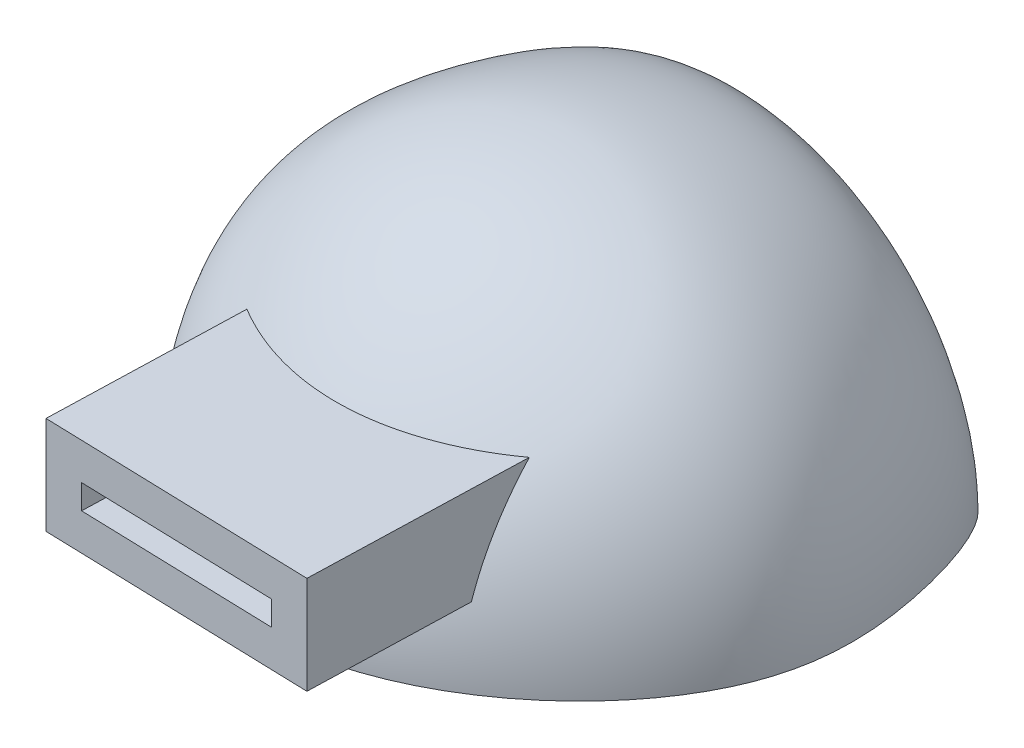
ISO-10303-21;
HEADER;
FILE_DESCRIPTION(('STEP AP214'),'2;1');
FILE_NAME('part.step','',(''),(''),'','','');
FILE_SCHEMA(('AUTOMOTIVE_DESIGN { 1 0 10303 214 1 1 1 1 }'));
ENDSEC;
DATA;
#1=APPLICATION_CONTEXT('core data for automotive mechanical design processes');
#2=APPLICATION_PROTOCOL_DEFINITION('international standard','automotive_design',2000,#1);
#3=PRODUCT_CONTEXT('',#1,'mechanical');
#4=PRODUCT('Part','Part','',(#3));
#5=PRODUCT_RELATED_PRODUCT_CATEGORY('part','',(#4));
#6=PRODUCT_DEFINITION_FORMATION('','',#4);
#7=PRODUCT_DEFINITION_CONTEXT('part definition',#1,'design');
#8=PRODUCT_DEFINITION('design','',#6,#7);
#9=PRODUCT_DEFINITION_SHAPE('','',#8);
#10=(LENGTH_UNIT() NAMED_UNIT(*) SI_UNIT(.MILLI.,.METRE.));
#11=(NAMED_UNIT(*) PLANE_ANGLE_UNIT() SI_UNIT($,.RADIAN.));
#12=(NAMED_UNIT(*) SI_UNIT($,.STERADIAN.) SOLID_ANGLE_UNIT());
#13=UNCERTAINTY_MEASURE_WITH_UNIT(LENGTH_MEASURE(1.E-05),#10,'distance_accuracy_value','');
#14=(GEOMETRIC_REPRESENTATION_CONTEXT(3) GLOBAL_UNCERTAINTY_ASSIGNED_CONTEXT((#13)) GLOBAL_UNIT_ASSIGNED_CONTEXT((#10,
#11,#12)) REPRESENTATION_CONTEXT('',''));
#15=CARTESIAN_POINT('',(0.,0.,0.));
#16=DIRECTION('',(0.,0.,1.));
#17=DIRECTION('',(1.,0.,0.));
#18=AXIS2_PLACEMENT_3D('',#15,#16,#17);
#19=CARTESIAN_POINT('',(32.4962022469968,0.,102.83057949245));
#20=CARTESIAN_POINT('',(3.63740284581316,-2.01519919141301E-13,101.966794634852));
#21=CARTESIAN_POINT('',(-41.2918886215931,-5.15259484593087E-13,68.6518971640335));
#22=CARTESIAN_POINT('',(-47.3556817021126,-5.57602725359566E-13,13.7258285385595));
#23=CARTESIAN_POINT('',(-28.0490768948956,-4.22785424557932E-13,-34.1624550244812));
#24=CARTESIAN_POINT('',(-17.0656238086389,-3.46088381584483E-13,-7.87034548185628));
#25=B_SPLINE_CURVE_WITH_KNOTS('',3,(#19,#20,#21,#22,#23,#24),.UNSPECIFIED.,.F.,.F.,(4,1,1,4),
(0.,0.487288000526579,0.732410890174815,1.),.UNSPECIFIED.);
#26=CARTESIAN_POINT('',(32.4962022469969,0.,75.7592184914926));
#27=DIRECTION('',(0.,0.,-1.));
#28=AXIS1_PLACEMENT('',#26,#27);
#29=SURFACE_OF_REVOLUTION('',#25,#28);
#30=CARTESIAN_POINT('',(70.6752901827735,19.0044396901906,87.1628960990123));
#31=CARTESIAN_POINT('',(70.1627807045949,19.0044396901906,87.4924475623718));
#32=CARTESIAN_POINT('',(69.6468866148386,19.0044396901906,87.8167075736631));
#33=CARTESIAN_POINT('',(68.6084453018209,19.0044396901906,88.4544057348588));
#34=CARTESIAN_POINT('',(68.0858980032465,19.0044396901906,88.7678437621112));
#35=CARTESIAN_POINT('',(66.5086136191303,19.0044396901906,89.6914701088784));
#36=CARTESIAN_POINT('',(65.4440920109388,19.0044396901906,90.2850621140087));
#37=CARTESIAN_POINT('',(63.2799963267178,19.0044396901906,91.430993347369));
#38=CARTESIAN_POINT('',(62.1801843985382,19.0044396901906,91.9828838017109));
#39=CARTESIAN_POINT('',(59.9565074436994,19.0044396901906,93.0363370675001));
#40=CARTESIAN_POINT('',(58.8326372804168,19.0044396901906,93.5378889985828));
#41=CARTESIAN_POINT('',(55.8591346450601,19.0044396901906,94.7815195063266));
#42=CARTESIAN_POINT('',(53.9909618745414,19.0044396901906,95.4802613006004));
#43=CARTESIAN_POINT('',(51.1504942668666,19.0044396901906,96.410930656643));
#44=CARTESIAN_POINT('',(50.1970830624926,19.0044396901906,96.7016324925216));
#45=CARTESIAN_POINT('',(48.2784932210553,19.0044396901906,97.2416589636689));
#46=CARTESIAN_POINT('',(47.3133143601125,19.0044396901906,97.4909828103996));
#47=CARTESIAN_POINT('',(45.3773425436937,19.0044396901906,97.9447561847595));
#48=CARTESIAN_POINT('',(44.4065987820788,19.0044396901906,98.1494153889265));
#49=CARTESIAN_POINT('',(42.4566799042396,19.0044396901906,98.5129761224555));
#50=CARTESIAN_POINT('',(41.4775059541936,19.0044396901906,98.6718838792711));
#51=CARTESIAN_POINT('',(39.5127349374555,19.0044396901906,98.9417022583437));
#52=CARTESIAN_POINT('',(38.5271391577425,19.0044396901906,99.0526222145451));
#53=CARTESIAN_POINT('',(36.551730314039,19.0044396901906,99.2246329942328));
#54=CARTESIAN_POINT('',(35.5619179107561,19.0044396901906,99.2857313551065));
#55=CARTESIAN_POINT('',(33.6376326172584,19.0044396901906,99.3549169762308));
#56=CARTESIAN_POINT('',(32.7032617293381,19.0044396901906,99.3658593439997));
#57=CARTESIAN_POINT('',(30.8349632096404,19.0044396901906,99.3423083935118));
#58=CARTESIAN_POINT('',(29.901035655781,19.0044396901906,99.3078088728151));
#59=CARTESIAN_POINT('',(28.0358338520568,19.0044396901906,99.1939584509386));
#60=CARTESIAN_POINT('',(27.104559893509,19.0044396901906,99.1146028026147));
#61=CARTESIAN_POINT('',(25.2468191396845,19.0044396901906,98.9123152675449));
#62=CARTESIAN_POINT('',(24.3203521341225,19.0044396901906,98.7893853035949));
#63=CARTESIAN_POINT('',(22.4699463272753,19.0044396901906,98.5010397617429));
#64=CARTESIAN_POINT('',(21.5460360781203,19.0044396901906,98.3354416061721));
#65=CARTESIAN_POINT('',(19.7064102459735,19.0044396901906,97.9639912350209));
#66=CARTESIAN_POINT('',(18.7906943097575,19.0044396901906,97.7581407633841));
#67=CARTESIAN_POINT('',(16.96873219531,19.0044396901906,97.3081954231202));
#68=CARTESIAN_POINT('',(16.062486011714,19.0044396901906,97.0641005761585));
#69=CARTESIAN_POINT('',(14.2607331208286,19.0044396901906,96.5396719485544));
#70=CARTESIAN_POINT('',(13.3652245411272,19.0044396901906,96.2593445895585));
#71=CARTESIAN_POINT('',(11.6389096304499,19.0044396901906,95.6820495443388));
#72=CARTESIAN_POINT('',(10.8074343505453,19.0044396901906,95.3870768906268));
#73=CARTESIAN_POINT('',(9.1555483613129,19.0044396901906,94.7681995988258));
#74=CARTESIAN_POINT('',(8.33513516704707,19.0044396901906,94.4443015873597));
#75=CARTESIAN_POINT('',(6.70582601396824,19.0044396901906,93.7688506239955));
#76=CARTESIAN_POINT('',(5.89692957189889,19.0044396901906,93.4172988365453));
#77=CARTESIAN_POINT('',(4.29802437872662,19.0044396901906,92.6908507341134));
#78=CARTESIAN_POINT('',(3.50791332600473,19.0044396901906,92.3161793908339));
#79=CARTESIAN_POINT('',(1.93999701268048,19.0044396901906,91.5418987181399));
#80=CARTESIAN_POINT('',(1.16219200564499,19.0044396901906,91.1422888757028));
#81=CARTESIAN_POINT('',(-0.380569243822995,19.0044396901906,90.319128806641));
#82=CARTESIAN_POINT('',(-1.14552650215761,19.0044396901906,89.89558048456));
#83=CARTESIAN_POINT('',(-1.90385857027581,19.0044396901906,89.4605263908626));
#84=B_SPLINE_CURVE_WITH_KNOTS('',3,(#30,#31,#32,#33,#34,#35,#36,#37,#38,#39,#40,#41,#42,#43,#44,
#45,#46,#47,#48,#49,#50,#51,#52,#53,#54,#55,#56,#57,#58,#59,#60,#61,#62,#63,#64,#65,#66,#67,#68,
#69,#70,#71,#72,#73,#74,#75,#76,#77,#78,#79,#80,#81,#82,#83),.UNSPECIFIED.,.F.,.F.,(4,2,2,2,2,2,
2,2,2,2,2,2,2,2,2,2,2,2,2,2,2,2,2,2,2,2,4),(0.,1.82789405544339,3.65580882070883,
7.31113201985178,11.0014103116931,14.6924845246337,20.6687958295295,23.6583079723965,
26.6478770796815,29.6230945502491,32.5979068577284,35.572140284116,38.5459236624738,
41.3481338985538,44.1507266526642,46.9536160619646,49.7563818040755,52.5713457618995,
55.3861877875723,58.2010282186271,61.0153704455503,63.6615564671374,66.3071378112488,
68.9526078145493,71.5754881899401,74.1984225397498,76.8211485020622),.UNSPECIFIED.);
#85=CARTESIAN_POINT('',(69.5862296756629,19.0044396901906,87.852014141075));
#86=VERTEX_POINT('',#85);
#87=CARTESIAN_POINT('',(-0.368933046591316,19.0044396901906,90.320349095192));
#88=VERTEX_POINT('',#87);
#89=EDGE_CURVE('E254',#86,#88,#84,.T.);
#90=ORIENTED_EDGE('',*,*,#89,.T.);
#91=CARTESIAN_POINT('',(-0.368933046591253,19.0044396901906,90.320349095192));
#92=CARTESIAN_POINT('',(-0.361832899985826,19.7670553136122,90.0831352741778));
#93=CARTESIAN_POINT('',(-0.354337370539547,20.5255335389678,89.8327118281157));
#94=CARTESIAN_POINT('',(-0.338583864889668,22.0334021726318,89.3063918128753));
#95=CARTESIAN_POINT('',(-0.330326062304331,22.782794606579,89.0305010442323));
#96=CARTESIAN_POINT('',(-0.313073626238367,24.2719785038195,88.4541022022867));
#97=CARTESIAN_POINT('',(-0.304079039551685,25.0117705733903,88.1535956923562));
#98=CARTESIAN_POINT('',(-0.285457588189311,26.4749843631416,87.5314584498485));
#99=CARTESIAN_POINT('',(-0.27583674645347,27.1984917751186,87.2100289419299));
#100=CARTESIAN_POINT('',(-0.255918609667322,28.6350694368328,86.5445698187456));
#101=CARTESIAN_POINT('',(-0.245621278602265,29.3481391284142,86.2005390002377));
#102=CARTESIAN_POINT('',(-0.224372909687322,30.7633243834703,85.4906372107758));
#103=CARTESIAN_POINT('',(-0.213421859054544,31.4654397324038,85.1247658127491));
#104=CARTESIAN_POINT('',(-0.190559081107858,32.878518233759,84.360927089815));
#105=CARTESIAN_POINT('',(-0.178628663695698,33.5891435190208,83.9623353341926));
#106=CARTESIAN_POINT('',(-0.154119400759546,34.9977754303489,83.1434880294222));
#107=CARTESIAN_POINT('',(-0.141540561449304,35.6957821772506,82.7232326878739));
#108=CARTESIAN_POINT('',(-0.115753762191825,37.0787005964373,81.8617032683377));
#109=CARTESIAN_POINT('',(-0.102545792998058,37.7636120760492,81.4204288814262));
#110=CARTESIAN_POINT('',(-0.0753989107199258,39.1258456393401,80.513459486048));
#111=CARTESIAN_POINT('',(-0.0614545522370669,39.8030464751044,80.0475825484107));
#112=CARTESIAN_POINT('',(-0.0329610030419439,41.1430596384117,79.0956214052891));
#113=CARTESIAN_POINT('',(-0.0184118232922416,41.8058722264146,78.6095375660607));
#114=CARTESIAN_POINT('',(0.0112758365633988,43.1165184003043,77.6176815350957));
#115=CARTESIAN_POINT('',(0.0264142786142109,43.7643529491943,77.1119106147696));
#116=CARTESIAN_POINT('',(0.0418404072622344,44.4044396901906,76.5965281693904));
#117=B_SPLINE_CURVE_WITH_KNOTS('',3,(#91,#92,#93,#94,#95,#96,#97,#98,#99,#100,#101,#102,#103,
#104,#105,#106,#107,#108,#109,#110,#111,#112,#113,#114,#115,#116),.UNSPECIFIED.,.F.,.F.,(4,2,2,
2,2,2,2,2,2,2,2,2,4),(0.,2.39591097643896,4.79127759113873,7.1864921913294,9.56135137806849,
11.9363370995121,14.3113692768646,16.7555727191882,19.1997527433504,21.6439687015148,
24.1098702114467,26.5757270456656,29.0414248958331),.UNSPECIFIED.);
#118=CARTESIAN_POINT('',(0.0418404072622376,44.4044396901906,76.5965281693904));
#119=VERTEX_POINT('',#118);
#120=EDGE_CURVE('E11',#88,#119,#117,.T.);
#121=ORIENTED_EDGE('',*,*,#120,.T.);
#122=CARTESIAN_POINT('',(-1.90385857027581,44.4044396901906,75.3870221250907));
#123=CARTESIAN_POINT('',(-1.17569578967299,44.4044396901906,75.8564030169936));
#124=CARTESIAN_POINT('',(-0.438808699805109,44.4044396901906,76.31227066644));
#125=CARTESIAN_POINT('',(1.05153960920156,44.4044396901906,77.1961251639984));
#126=CARTESIAN_POINT('',(1.80500150908879,44.4044396901906,77.6241108640929));
#127=CARTESIAN_POINT('',(3.32755197126023,44.4044396901906,78.451301364138));
#128=CARTESIAN_POINT('',(4.09664026846199,44.4044396901906,78.850506651791));
#129=CARTESIAN_POINT('',(5.65315395800761,44.4044396901906,79.6209880593173));
#130=CARTESIAN_POINT('',(6.44064811851702,44.4044396901906,79.992125307811));
#131=CARTESIAN_POINT('',(8.02955401496943,44.4044396901906,80.7034084842931));
#132=CARTESIAN_POINT('',(8.83096620493236,44.4044396901906,81.0435533990114));
#133=CARTESIAN_POINT('',(10.4467679916661,44.4044396901906,81.69184146194));
#134=CARTESIAN_POINT('',(11.2611596402558,44.4044396901906,81.9999794913829));
#135=CARTESIAN_POINT('',(13.1710686341432,44.4044396901906,82.6788770761318));
#136=CARTESIAN_POINT('',(14.2711137188962,44.4044396901906,83.0369894126901));
#137=CARTESIAN_POINT('',(16.4893682469757,44.4044396901906,83.6923714589582));
#138=CARTESIAN_POINT('',(17.6075805564821,44.4044396901906,83.9896314655955));
#139=CARTESIAN_POINT('',(19.858990475973,44.4044396901906,84.5209562580403));
#140=CARTESIAN_POINT('',(20.992188542756,44.4044396901906,84.7550191127823));
#141=CARTESIAN_POINT('',(23.2678478145627,44.4044396901906,85.1575165921489));
#142=CARTESIAN_POINT('',(24.4102857861487,44.4044396901906,85.3260823537505));
#143=CARTESIAN_POINT('',(26.703007176186,44.4044396901906,85.5966874405351));
#144=CARTESIAN_POINT('',(27.8532904352705,44.4044396901906,85.6987281130457));
#145=CARTESIAN_POINT('',(30.1578051363618,44.4044396901906,85.8352827235318));
#146=CARTESIAN_POINT('',(31.3120363590652,44.4044396901906,85.8698003531925));
#147=CARTESIAN_POINT('',(33.6090727049583,44.4044396901906,85.8709667376019));
#148=CARTESIAN_POINT('',(34.7518775427994,44.4044396901906,85.8382856387969));
#149=CARTESIAN_POINT('',(37.0337070090699,44.4044396901906,85.7067225981196));
#150=CARTESIAN_POINT('',(38.1727314925243,44.4044396901906,85.6078381461939));
#151=CARTESIAN_POINT('',(40.4431870101557,44.4044396901906,85.3448202708044));
#152=CARTESIAN_POINT('',(41.5746181652557,44.4044396901906,85.1806878889273));
#153=CARTESIAN_POINT('',(43.8290972786894,44.4044396901906,84.7881949219389));
#154=CARTESIAN_POINT('',(44.9521181868318,44.4044396901906,84.5596792404567));
#155=CARTESIAN_POINT('',(47.1836886722629,44.4044396901906,84.0405198316586));
#156=CARTESIAN_POINT('',(48.2922381484128,44.4044396901906,83.7498756703826));
#157=CARTESIAN_POINT('',(50.4918215130563,44.4044396901906,83.1086925055687));
#158=CARTESIAN_POINT('',(51.5828558370526,44.4044396901906,82.7581549937714));
#159=CARTESIAN_POINT('',(53.7403599821625,44.4044396901906,82.0010850798211));
#160=CARTESIAN_POINT('',(54.806911011693,44.4044396901906,81.5947837797508));
#161=CARTESIAN_POINT('',(56.9175293693596,44.4044396901906,80.7274993316025));
#162=CARTESIAN_POINT('',(57.9615965207951,44.4044396901906,80.2665157539622));
#163=CARTESIAN_POINT('',(60.0250885777313,44.4044396901906,79.2921453397461));
#164=CARTESIAN_POINT('',(61.0445110729295,44.4044396901906,78.7787534029547));
#165=CARTESIAN_POINT('',(63.0520201954706,44.4044396901906,77.7041865644699));
#166=CARTESIAN_POINT('',(64.0402257586025,44.4044396901906,77.1432337075124));
#167=CARTESIAN_POINT('',(65.9878458042406,44.4044396901906,75.9736845512681));
#168=CARTESIAN_POINT('',(66.9472639404147,44.4044396901906,75.3650943337464));
#169=CARTESIAN_POINT('',(68.8350063750698,44.4044396901906,74.1022152688637));
#170=CARTESIAN_POINT('',(69.7633424756862,44.4044396901906,73.447944064952));
#171=CARTESIAN_POINT('',(70.6752901827735,44.4044396901906,72.7716011741849));
#172=B_SPLINE_CURVE_WITH_KNOTS('',3,(#122,#123,#124,#125,#126,#127,#128,#129,#130,#131,#132,
#133,#134,#135,#136,#137,#138,#139,#140,#141,#142,#143,#144,#145,#146,#147,#148,#149,#150,#151,
#152,#153,#154,#155,#156,#157,#158,#159,#160,#161,#162,#163,#164,#165,#166,#167,#168,#169,#170,
#171),.UNSPECIFIED.,.F.,.F.,(4,2,2,2,2,2,2,2,2,2,2,2,2,2,2,2,2,2,2,2,2,2,2,2,4),(0.,
2.59887807548837,5.19786309021486,7.79680405313534,10.407860389899,13.0190020624985,
15.6305606864555,19.0993907075574,22.5687734131184,26.0382621178672,29.5007680391919,
32.9632038324677,36.4254503188113,39.8533366863063,43.2813530270506,46.7093146467843,
50.1456057280798,53.5819208122598,57.0181503219506,60.4405464535099,63.8629694718419,
67.2857258676309,70.6933004249081,74.1004406513937,77.5062721349178),.UNSPECIFIED.);
#173=CARTESIAN_POINT('',(70.023307304485,44.4044396901906,73.2493784245805));
#174=VERTEX_POINT('',#173);
#175=EDGE_CURVE('E53',#119,#174,#172,.T.);
#176=ORIENTED_EDGE('',*,*,#175,.T.);
#177=CARTESIAN_POINT('',(70.023307304485,44.4044396901906,73.2493784245805));
#178=CARTESIAN_POINT('',(70.0060332621695,43.7453334795124,73.8264991250046));
#179=CARTESIAN_POINT('',(69.9891004946133,43.0762401090038,74.3922179355547));
#180=CARTESIAN_POINT('',(69.9559342591869,41.7188643374741,75.5002921587175));
#181=CARTESIAN_POINT('',(69.9397008526972,41.0305802608498,76.0426455206279));
#182=CARTESIAN_POINT('',(69.9079525898062,39.6357007414357,77.1033456961936));
#183=CARTESIAN_POINT('',(69.8924377575122,38.9291046855452,77.6216917044388));
#184=CARTESIAN_POINT('',(69.8623097752771,37.5060392141098,78.6282587772878));
#185=CARTESIAN_POINT('',(69.847688776359,36.7897553465665,79.1167420739242));
#186=CARTESIAN_POINT('',(69.8191934987764,35.340772788314,80.0687609619654));
#187=CARTESIAN_POINT('',(69.8053191976605,34.6080745920835,80.5322973034653));
#188=CARTESIAN_POINT('',(69.7783437629518,33.1270942771695,81.4335386857048));
#189=CARTESIAN_POINT('',(69.7652426121627,32.3788125055932,81.8712443009651));
#190=CARTESIAN_POINT('',(69.7189755863458,29.6258720882422,83.4170120985761));
#191=CARTESIAN_POINT('',(69.6881777703404,27.575287594599,84.4459581217392));
#192=CARTESIAN_POINT('',(69.6511378816456,24.7754913670599,85.6834499674066));
#193=CARTESIAN_POINT('',(69.6421600479922,24.0654463013394,85.9833967633936));
#194=CARTESIAN_POINT('',(69.6249217228358,22.6355440988497,86.5593241639798));
#195=CARTESIAN_POINT('',(69.6166612835502,21.9156862522348,86.8353030240062));
#196=CARTESIAN_POINT('',(69.6008820981833,20.4667551039613,87.3624809910811));
#197=CARTESIAN_POINT('',(69.5933635287675,19.7376796536714,87.6136741957844));
#198=CARTESIAN_POINT('',(69.5862296756629,19.0044396901906,87.852014141075));
#199=B_SPLINE_CURVE_WITH_KNOTS('',3,(#177,#178,#179,#180,#181,#182,#183,#184,#185,#186,#187,
#188,#189,#190,#191,#192,#193,#194,#195,#196,#197,#198),.UNSPECIFIED.,.F.,.F.,(4,2,2,2,2,2,2,2,
2,2,4),(0.,2.62856719259501,5.25736461714387,7.88625017005048,10.4871114317929,13.0878944481401,
15.6886195967049,22.5587707130488,24.8710892174879,27.1835758896362,29.4966119246941),.UNSPECIFIED.);
#200=EDGE_CURVE('E261',#174,#86,#199,.T.);
#201=ORIENTED_EDGE('',*,*,#200,.T.);
#202=EDGE_LOOP('',(#90,#121,#176,#201));
#203=FACE_BOUND('',#202,.T.);
#204=CARTESIAN_POINT('',(32.4962022469969,0.,-7.87034548185628));
#205=DIRECTION('',(0.,0.,-1.));
#206=DIRECTION('',(-1.,0.,0.));
#207=AXIS2_PLACEMENT_3D('',#204,#205,#206);
#208=CIRCLE('',#207,49.5618260556358);
#209=CARTESIAN_POINT('',(-17.0656238086389,-3.46088381584483E-13,-7.87034548185628));
#210=VERTEX_POINT('',#209);
#211=CARTESIAN_POINT('',(82.0580283026326,0.,-7.87034548185628));
#212=VERTEX_POINT('',#211);
#213=EDGE_CURVE('E310',#210,#212,#208,.T.);
#214=ORIENTED_EDGE('',*,*,#213,.F.);
#215=CARTESIAN_POINT('',(32.4962022469969,0.,102.83057949245));
#216=VERTEX_POINT('',#215);
#217=EDGE_CURVE('E202',#216,#210,#25,.T.);
#218=ORIENTED_EDGE('',*,*,#217,.F.);
#219=CARTESIAN_POINT('',(32.4962022469969,0.,102.83057949245));
#220=CARTESIAN_POINT('',(61.3550016481805,0.,101.966794634852));
#221=CARTESIAN_POINT('',(106.284293115587,0.,68.6518971640335));
#222=CARTESIAN_POINT('',(112.348086196106,0.,13.7258285385595));
#223=CARTESIAN_POINT('',(93.0414813888893,0.,-34.1624550244812));
#224=CARTESIAN_POINT('',(82.0580283026326,0.,-7.87034548185628));
#225=B_SPLINE_CURVE_WITH_KNOTS('',3,(#219,#220,#221,#222,#223,#224),.UNSPECIFIED.,.F.,.F.,(4,1,
1,4),(0.,0.487288000526579,0.732410890174815,1.),.UNSPECIFIED.);
#226=EDGE_CURVE('E182',#216,#212,#225,.T.);
#227=ORIENTED_EDGE('',*,*,#226,.T.);
#228=EDGE_LOOP('',(#214,#218,#227));
#229=FACE_BOUND('',#228,.T.);
#230=ADVANCED_FACE('F39',(#203,#229),#29,.T.);
#231=CARTESIAN_POINT('',(64.9924044939937,0.,0.));
#232=DIRECTION('',(0.,-1.,0.));
#233=DIRECTION('',(-1.,0.,0.));
#234=AXIS2_PLACEMENT_3D('',#231,#232,#233);
#235=CIRCLE('',#234,82.4345943577054);
#236=TRIMMED_CURVE('',#235,(PARAMETER_VALUE(-1.16559272262157)),
(PARAMETER_VALUE(1.16559272262157)),.T.,.PARAMETER.);
#237=CARTESIAN_POINT('',(32.4962022469969,0.,0.));
#238=DIRECTION('',(0.,0.,-1.));
#239=AXIS1_PLACEMENT('',#237,#238);
#240=SURFACE_OF_REVOLUTION('',#236,#239);
#241=CARTESIAN_POINT('',(0.,0.,0.));
#242=DIRECTION('',(0.,-1.,0.));
#243=DIRECTION('',(0.,0.,-1.));
#244=AXIS2_PLACEMENT_3D('',#241,#242,#243);
#245=CIRCLE('',#244,82.4345943577054);
#246=CARTESIAN_POINT('',(32.4962022469969,0.,75.7592184914926));
#247=VERTEX_POINT('',#246);
#248=EDGE_CURVE('E196',#212,#247,#245,.T.);
#249=ORIENTED_EDGE('',*,*,#248,.T.);
#250=CARTESIAN_POINT('',(64.9924044939937,2.26919767457324E-13,0.));
#251=DIRECTION('',(0.,1.,0.));
#252=DIRECTION('',(0.,0.,-1.));
#253=AXIS2_PLACEMENT_3D('',#250,#251,#252);
#254=CIRCLE('',#253,82.4345943577054);
#255=EDGE_CURVE('E209',#210,#247,#254,.T.);
#256=ORIENTED_EDGE('',*,*,#255,.F.);
#257=ORIENTED_EDGE('',*,*,#213,.T.);
#258=EDGE_LOOP('',(#249,#256,#257));
#259=FACE_BOUND('',#258,.T.);
#260=ADVANCED_FACE('F41',(#259),#240,.F.);
#261=CARTESIAN_POINT('',(-39.1253822110164,-5.00130851187061E-13,52.5953796265315));
#262=DIRECTION('',(0.,-1.,0.));
#263=DIRECTION('',(0.,0.,1.));
#264=AXIS2_PLACEMENT_3D('',#261,#262,#263);
#265=PLANE('',#264);
#266=ORIENTED_EDGE('',*,*,#217,.T.);
#267=ORIENTED_EDGE('',*,*,#255,.T.);
#268=ORIENTED_EDGE('',*,*,#248,.F.);
#269=ORIENTED_EDGE('',*,*,#226,.F.);
#270=EDGE_LOOP('',(#266,#267,#268,#269));
#271=FACE_BOUND('',#270,.T.);
#272=ADVANCED_FACE('F219',(#271),#265,.T.);
#273=CARTESIAN_POINT('',(0.426246971987767,19.0044396901906,63.7536172959985));
#274=DIRECTION('',(-0.999552355793426,0.,-0.0299180217897425));
#275=DIRECTION('',(-0.0299180217897426,0.,0.999552355793427));
#276=AXIS2_PLACEMENT_3D('',#273,#274,#275);
#277=PLANE('',#276);
#278=ORIENTED_EDGE('',*,*,#120,.F.);
#279=DIRECTION('',(-0.0299180217897425,0.,0.999552355793426));
#280=VECTOR('',#279,1.);
#281=CARTESIAN_POINT('',(0.426246971987767,19.0044396901906,63.7536172959985));
#282=LINE('',#281,#280);
#283=CARTESIAN_POINT('',(-1.47354741166089,19.0044396901906,127.225191888881));
#284=VERTEX_POINT('',#283);
#285=EDGE_CURVE('E60',#88,#284,#282,.T.);
#286=ORIENTED_EDGE('',*,*,#285,.T.);
#287=DIRECTION('',(0.,-1.,0.));
#288=VECTOR('',#287,1.);
#289=CARTESIAN_POINT('',(-1.47354741166089,19.0044396901906,127.225191888881));
#290=LINE('',#289,#288);
#291=CARTESIAN_POINT('',(-1.47354741166089,44.4044396901906,127.225191888881));
#292=VERTEX_POINT('',#291);
#293=EDGE_CURVE('E157',#292,#284,#290,.T.);
#294=ORIENTED_EDGE('',*,*,#293,.F.);
#295=DIRECTION('',(-0.0299180217897425,0.,0.999552355793426));
#296=VECTOR('',#295,1.);
#297=CARTESIAN_POINT('',(0.426246971987767,44.4044396901906,63.7536172959985));
#298=LINE('',#297,#296);
#299=EDGE_CURVE('E179',#119,#292,#298,.T.);
#300=ORIENTED_EDGE('',*,*,#299,.F.);
#301=EDGE_LOOP('',(#278,#286,#294,#300));
#302=FACE_BOUND('',#301,.T.);
#303=ADVANCED_FACE('F278',(#302),#277,.T.);
#304=CARTESIAN_POINT('',(70.2449790241586,44.4044396901906,65.843391118012));
#305=DIRECTION('',(0.,1.,0.));
#306=DIRECTION('',(0.,0.,1.));
#307=AXIS2_PLACEMENT_3D('',#304,#305,#306);
#308=PLANE('',#307);
#309=ORIENTED_EDGE('',*,*,#175,.F.);
#310=ORIENTED_EDGE('',*,*,#299,.T.);
#311=DIRECTION('',(-0.999552355793426,0.,-0.0299180217897425));
#312=VECTOR('',#311,1.);
#313=CARTESIAN_POINT('',(68.3451846405099,44.4044396901906,129.314965710895));
#314=LINE('',#313,#312);
#315=CARTESIAN_POINT('',(68.3451846405099,44.4044396901906,129.314965710895));
#316=VERTEX_POINT('',#315);
#317=EDGE_CURVE('E134',#316,#292,#314,.T.);
#318=ORIENTED_EDGE('',*,*,#317,.F.);
#319=DIRECTION('',(-0.0299180217897425,0.,0.999552355793426));
#320=VECTOR('',#319,1.);
#321=CARTESIAN_POINT('',(70.2449790241586,44.4044396901906,65.843391118012));
#322=LINE('',#321,#320);
#323=EDGE_CURVE('E183',#174,#316,#322,.T.);
#324=ORIENTED_EDGE('',*,*,#323,.F.);
#325=EDGE_LOOP('',(#309,#310,#318,#324));
#326=FACE_BOUND('',#325,.T.);
#327=ADVANCED_FACE('F274',(#326),#308,.T.);
#328=CARTESIAN_POINT('',(70.2449790241586,19.0044396901906,65.843391118012));
#329=DIRECTION('',(0.999552355793426,0.,0.0299180217897425));
#330=DIRECTION('',(0.0299180217897426,0.,-0.999552355793427));
#331=AXIS2_PLACEMENT_3D('',#328,#329,#330);
#332=PLANE('',#331);
#333=ORIENTED_EDGE('',*,*,#200,.F.);
#334=ORIENTED_EDGE('',*,*,#323,.T.);
#335=DIRECTION('',(0.,1.,0.));
#336=VECTOR('',#335,1.);
#337=CARTESIAN_POINT('',(68.3451846405099,19.0044396901906,129.314965710895));
#338=LINE('',#337,#336);
#339=CARTESIAN_POINT('',(68.3451846405099,19.0044396901906,129.314965710895));
#340=VERTEX_POINT('',#339);
#341=EDGE_CURVE('E165',#340,#316,#338,.T.);
#342=ORIENTED_EDGE('',*,*,#341,.F.);
#343=DIRECTION('',(-0.0299180217897425,0.,0.999552355793426));
#344=VECTOR('',#343,1.);
#345=CARTESIAN_POINT('',(70.2449790241586,19.0044396901906,65.843391118012));
#346=LINE('',#345,#344);
#347=EDGE_CURVE('E186',#86,#340,#346,.T.);
#348=ORIENTED_EDGE('',*,*,#347,.F.);
#349=EDGE_LOOP('',(#333,#334,#342,#348));
#350=FACE_BOUND('',#349,.T.);
#351=ADVANCED_FACE('F277',(#350),#332,.T.);
#352=CARTESIAN_POINT('',(70.2449790241586,19.0044396901906,65.843391118012));
#353=DIRECTION('',(0.,-1.,0.));
#354=DIRECTION('',(0.,0.,-1.));
#355=AXIS2_PLACEMENT_3D('',#352,#353,#354);
#356=PLANE('',#355);
#357=ORIENTED_EDGE('',*,*,#89,.F.);
#358=ORIENTED_EDGE('',*,*,#347,.T.);
#359=DIRECTION('',(0.999552355793426,0.,0.0299180217897425));
#360=VECTOR('',#359,1.);
#361=CARTESIAN_POINT('',(68.3451846405099,19.0044396901906,129.314965710895));
#362=LINE('',#361,#360);
#363=EDGE_CURVE('E161',#284,#340,#362,.T.);
#364=ORIENTED_EDGE('',*,*,#363,.F.);
#365=ORIENTED_EDGE('',*,*,#285,.F.);
#366=EDGE_LOOP('',(#357,#358,#364,#365));
#367=FACE_BOUND('',#366,.T.);
#368=ADVANCED_FACE('F283',(#367),#356,.T.);
#369=CARTESIAN_POINT('',(60.7242428352261,34.8794396901906,65.5584219604647));
#370=DIRECTION('',(0.999552355793426,0.,0.0299180217897425));
#371=DIRECTION('',(0.0299180217897426,0.,-0.999552355793427));
#372=AXIS2_PLACEMENT_3D('',#369,#370,#371);
#373=PLANE('',#372);
#374=DIRECTION('',(-0.0299180217897425,0.,0.999552355793426));
#375=VECTOR('',#374,1.);
#376=CARTESIAN_POINT('',(60.7242428352261,34.8794396901906,65.5584219604647));
#377=LINE('',#376,#375);
#378=CARTESIAN_POINT('',(60.1182571555469,34.8794396901906,85.8042262438245));
#379=VERTEX_POINT('',#378);
#380=CARTESIAN_POINT('',(58.8244484515775,34.8794396901906,129.029996553347));
#381=VERTEX_POINT('',#380);
#382=EDGE_CURVE('E123',#379,#381,#377,.T.);
#383=ORIENTED_EDGE('',*,*,#382,.F.);
#384=CARTESIAN_POINT('',(60.1182571555469,34.8794396901906,85.8042262438245));
#385=CARTESIAN_POINT('',(60.1145467900875,34.6729702564372,85.9281884683946));
#386=CARTESIAN_POINT('',(60.1108637830498,34.4659514368329,86.0512366561011));
#387=CARTESIAN_POINT('',(60.1035542308258,34.0508939860426,86.2954466575709));
#388=CARTESIAN_POINT('',(60.0999276676339,33.8428557091149,86.4166090728999));
#389=CARTESIAN_POINT('',(60.0927312172952,33.4257551970306,86.6570403734722));
#390=CARTESIAN_POINT('',(60.0891613163875,33.2166932271374,86.7763097184616));
#391=CARTESIAN_POINT('',(60.0820784367514,32.7975406511051,87.0129466550803));
#392=CARTESIAN_POINT('',(60.0785654486475,32.5874502219693,87.130314559943));
#393=CARTESIAN_POINT('',(60.0715966679787,32.1662355044938,87.3631394834457));
#394=CARTESIAN_POINT('',(60.0681408705801,31.9551113055,87.4785966635746));
#395=CARTESIAN_POINT('',(60.06128674084,31.5318212493272,87.7075911330885));
#396=CARTESIAN_POINT('',(60.0578884089291,31.3196553843583,87.8211284080874));
#397=CARTESIAN_POINT('',(60.0511495821479,30.8942780992635,88.0462706394715));
#398=CARTESIAN_POINT('',(60.0478090919429,30.6810665965666,88.1578754399962));
#399=CARTESIAN_POINT('',(60.0411863181603,30.2535917131872,88.3791403746498));
#400=CARTESIAN_POINT('',(60.0379040441985,30.0393281660626,88.4888001875205));
#401=CARTESIAN_POINT('',(60.0313981015612,29.6097423359922,88.7061618277858));
#402=CARTESIAN_POINT('',(60.0281744476593,29.3944198030661,88.8138631616049));
#403=CARTESIAN_POINT('',(60.021786178582,28.9627086691943,89.0272933626554));
#404=CARTESIAN_POINT('',(60.0186215835649,28.7463197350032,89.1330215564088));
#405=CARTESIAN_POINT('',(60.0154873968381,28.5294396901906,89.2377338180768));
#406=B_SPLINE_CURVE_WITH_KNOTS('',3,(#384,#385,#386,#387,#388,#389,#390,#391,#392,#393,#394,
#395,#396,#397,#398,#399,#400,#401,#402,#403,#404,#405),.UNSPECIFIED.,.F.,.F.,(4,2,2,2,2,2,2,2,
2,2,4),(0.,0.722555907032705,1.44487638693733,2.1670186758409,2.88904076771093,3.61100152155336,
4.33296768275902,5.05499180426874,5.77713409403634,6.49945592387255,7.22201994872588),.UNSPECIFIED.);
#407=CARTESIAN_POINT('',(60.0154873968381,28.5294396901906,89.2377338180768));
#408=VERTEX_POINT('',#407);
#409=EDGE_CURVE('E246',#379,#408,#406,.T.);
#410=ORIENTED_EDGE('',*,*,#409,.T.);
#411=DIRECTION('',(-0.0299180217897425,0.,0.999552355793426));
#412=VECTOR('',#411,1.);
#413=CARTESIAN_POINT('',(60.7242428352261,28.5294396901906,65.5584219604647));
#414=LINE('',#413,#412);
#415=CARTESIAN_POINT('',(58.8244484515775,28.5294396901906,129.029996553347));
#416=VERTEX_POINT('',#415);
#417=EDGE_CURVE('E140',#408,#416,#414,.T.);
#418=ORIENTED_EDGE('',*,*,#417,.T.);
#419=DIRECTION('',(0.,1.,0.));
#420=VECTOR('',#419,1.);
#421=CARTESIAN_POINT('',(58.8244484515775,34.8794396901906,129.029996553347));
#422=LINE('',#421,#420);
#423=EDGE_CURVE('E137',#416,#381,#422,.T.);
#424=ORIENTED_EDGE('',*,*,#423,.T.);
#425=EDGE_LOOP('',(#383,#410,#418,#424));
#426=FACE_BOUND('',#425,.T.);
#427=ADVANCED_FACE('F138',(#426),#373,.F.);
#428=CARTESIAN_POINT('',(9.94698316092007,28.5294396901906,64.0385864535458));
#429=DIRECTION('',(0.,-1.,0.));
#430=DIRECTION('',(0.,0.,-1.));
#431=AXIS2_PLACEMENT_3D('',#428,#429,#430);
#432=PLANE('',#431);
#433=ORIENTED_EDGE('',*,*,#417,.F.);
#434=CARTESIAN_POINT('',(61.0403051595739,28.5294396901906,88.757834424835));
#435=CARTESIAN_POINT('',(60.4947751825549,28.5294396901906,89.0181986299704));
#436=CARTESIAN_POINT('',(59.9461841881798,28.5294396901906,89.2721646666356));
#437=CARTESIAN_POINT('',(58.8430328912614,28.5294396901906,89.7669509239628));
#438=CARTESIAN_POINT('',(58.2884719265799,28.5294396901906,90.0077696680747));
#439=CARTESIAN_POINT('',(57.1736388990694,28.5294396901906,90.4758604241376));
#440=CARTESIAN_POINT('',(56.6133666636296,28.5294396901906,90.7031320252254));
#441=CARTESIAN_POINT('',(55.4873706753107,28.5294396901906,91.1437179970221));
#442=CARTESIAN_POINT('',(54.921647023428,28.5294396901906,91.3570326257386));
#443=CARTESIAN_POINT('',(53.7837509026735,28.5294396901906,91.7697461124862));
#444=CARTESIAN_POINT('',(53.2115670853224,28.5294396901906,91.96911370008));
#445=CARTESIAN_POINT('',(52.0622381887995,28.5294396901906,92.3529954863452));
#446=CARTESIAN_POINT('',(51.4850931256701,28.5294396901906,92.5375097330254));
#447=CARTESIAN_POINT('',(50.3260944824534,28.5294396901906,92.891264079029));
#448=CARTESIAN_POINT('',(49.7442405990613,28.5294396901906,93.0605031857781));
#449=CARTESIAN_POINT('',(48.5760903946069,28.5294396901906,93.3832841556689));
#450=CARTESIAN_POINT('',(47.9897933101678,28.5294396901906,93.5368232525967));
#451=CARTESIAN_POINT('',(46.5526660296968,28.5294396901906,93.8921547689669));
#452=CARTESIAN_POINT('',(45.6996563438,28.5294396901906,94.0852092648217));
#453=CARTESIAN_POINT('',(43.9863081329597,28.5294396901906,94.4364478542066));
#454=CARTESIAN_POINT('',(43.1259681399488,28.5294396901906,94.5946247836629));
#455=CARTESIAN_POINT('',(41.3993751043843,28.5294396901906,94.874924041482));
#456=CARTESIAN_POINT('',(40.5331217709964,28.5294396901906,94.9970445832292));
#457=CARTESIAN_POINT('',(38.7961781602668,28.5294396901906,95.2042496719981));
#458=CARTESIAN_POINT('',(37.9254878318906,28.5294396901906,95.2893337920498));
#459=CARTESIAN_POINT('',(36.1815288853696,28.5294396901906,95.4217153602519));
#460=CARTESIAN_POINT('',(35.3082612387124,28.5294396901906,95.4690255771847));
#461=CARTESIAN_POINT('',(33.560474505923,28.5294396901906,95.5254838392652));
#462=CARTESIAN_POINT('',(32.685955399023,28.5294396901906,95.5346312435852));
#463=CARTESIAN_POINT('',(30.9374178980352,28.5294396901906,95.5146801847482));
#464=CARTESIAN_POINT('',(30.0633994740748,28.5294396901906,95.4855843090517));
#465=CARTESIAN_POINT('',(28.3175869188709,28.5294396901906,95.3894193692528));
#466=CARTESIAN_POINT('',(27.4457924474935,28.5294396901906,95.3223565111456));
#467=CARTESIAN_POINT('',(25.92915418684,28.5294396901906,95.1728636861036));
#468=CARTESIAN_POINT('',(25.2834717232147,28.5294396901906,95.0987914065731));
#469=CARTESIAN_POINT('',(23.9947805535317,28.5294396901906,94.9303391187186));
#470=CARTESIAN_POINT('',(23.3517717454558,28.5294396901906,94.8359598926274));
#471=CARTESIAN_POINT('',(22.0689548107647,28.5294396901906,94.6272937016671));
#472=CARTESIAN_POINT('',(21.429146898921,28.5294396901906,94.5130054189043));
#473=CARTESIAN_POINT('',(20.1532343453746,28.5294396901906,94.2649724858925));
#474=CARTESIAN_POINT('',(19.5171301732881,28.5294396901906,94.1312254219286));
#475=CARTESIAN_POINT('',(18.2491239871892,28.5294396901906,93.8447676196194));
#476=CARTESIAN_POINT('',(17.6172225276658,28.5294396901906,93.6920544292737));
#477=CARTESIAN_POINT('',(16.3567950017049,28.5294396901906,93.3678509825034));
#478=CARTESIAN_POINT('',(15.7282792516784,28.5294396901906,93.1963206508647));
#479=CARTESIAN_POINT('',(14.4764517516532,28.5294396901906,92.8353001435185));
#480=CARTESIAN_POINT('',(13.8531398468819,28.5294396901906,92.645810504042));
#481=CARTESIAN_POINT('',(12.6121952868817,28.5294396901906,92.2494435438242));
#482=CARTESIAN_POINT('',(11.9945616388942,28.5294396901906,92.0425693292158));
#483=CARTESIAN_POINT('',(10.7654459621079,28.5294396901906,91.6120209833923));
#484=CARTESIAN_POINT('',(10.1539616903087,28.5294396901906,91.3883532498194));
#485=CARTESIAN_POINT('',(8.93760684966496,28.5294396901906,90.9248119107841));
#486=CARTESIAN_POINT('',(8.33273235178089,28.5294396901906,90.6849486182004));
#487=CARTESIAN_POINT('',(7.7311264529237,28.5294396901906,90.437177381556));
#488=B_SPLINE_CURVE_WITH_KNOTS('',3,(#434,#435,#436,#437,#438,#439,#440,#441,#442,#443,#444,
#445,#446,#447,#448,#449,#450,#451,#452,#453,#454,#455,#456,#457,#458,#459,#460,#461,#462,#463,
#464,#465,#466,#467,#468,#469,#470,#471,#472,#473,#474,#475,#476,#477,#478,#479,#480,#481,#482,
#483,#484,#485,#486,#487),.UNSPECIFIED.,.F.,.F.,(4,2,2,2,2,2,2,2,2,2,2,2,2,2,2,2,2,2,2,2,2,2,2,
2,2,2,4),(0.,1.81339929657217,3.62700183571367,5.44065935055339,7.25428332876105,
9.07185127013178,10.8894133365475,12.7070934227306,14.525093219489,17.1480992134038,
19.771643488546,22.3953177400694,25.0190222375202,27.6418394633487,30.2647007311831,
32.8873845508218,35.5096397963475,37.4590859773477,39.4084570782454,41.3579572681818,
43.307699485409,45.2576940343534,47.2119252486507,49.1660981316554,51.1199225984696,
53.073006478447,55.0248582091583),.UNSPECIFIED.);
#489=CARTESIAN_POINT('',(9.13997348009987,28.5294396901906,91.0005438075742));
#490=VERTEX_POINT('',#489);
#491=EDGE_CURVE('E68',#408,#490,#488,.T.);
#492=ORIENTED_EDGE('',*,*,#491,.T.);
#493=DIRECTION('',(-0.0299180217897425,0.,0.999552355793426));
#494=VECTOR('',#493,1.);
#495=CARTESIAN_POINT('',(9.94698316092007,28.5294396901906,64.0385864535458));
#496=LINE('',#495,#494);
#497=CARTESIAN_POINT('',(8.04718877727142,28.5294396901906,127.510161046428));
#498=VERTEX_POINT('',#497);
#499=EDGE_CURVE('E174',#490,#498,#496,.T.);
#500=ORIENTED_EDGE('',*,*,#499,.T.);
#501=DIRECTION('',(0.999552355793426,0.,0.0299180217897425));
#502=VECTOR('',#501,1.);
#503=CARTESIAN_POINT('',(8.04718877727142,28.5294396901906,127.510161046428));
#504=LINE('',#503,#502);
#505=EDGE_CURVE('E152',#498,#416,#504,.T.);
#506=ORIENTED_EDGE('',*,*,#505,.T.);
#507=EDGE_LOOP('',(#433,#492,#500,#506));
#508=FACE_BOUND('',#507,.T.);
#509=ADVANCED_FACE('F364',(#508),#432,.F.);
#510=CARTESIAN_POINT('',(9.94698316092007,34.8794396901906,64.0385864535458));
#511=DIRECTION('',(-0.999552355793426,0.,-0.0299180217897425));
#512=DIRECTION('',(-0.0299180217897426,0.,0.999552355793427));
#513=AXIS2_PLACEMENT_3D('',#510,#511,#512);
#514=PLANE('',#513);
#515=ORIENTED_EDGE('',*,*,#499,.F.);
#516=CARTESIAN_POINT('',(9.13997348009987,28.5294396901906,91.0005438075742));
#517=CARTESIAN_POINT('',(9.14376748743907,28.8000416949159,90.8737871322687));
#518=CARTESIAN_POINT('',(9.14760688634608,29.0699323086599,90.745513937961));
#519=CARTESIAN_POINT('',(9.15537384750522,29.6081734002515,90.4860220377768));
#520=CARTESIAN_POINT('',(9.15930137768182,29.876524395188,90.354804403534));
#521=CARTESIAN_POINT('',(9.1672437673878,30.4116998502851,90.0894514869195));
#522=CARTESIAN_POINT('',(9.17125860615786,30.678524654676,89.9553168981105));
#523=CARTESIAN_POINT('',(9.17937485776501,31.210660319275,89.6841553062397));
#524=CARTESIAN_POINT('',(9.18347626057051,31.475971350431,89.5471286383301));
#525=CARTESIAN_POINT('',(9.19176491380941,32.0050886532542,89.2702071583763));
#526=CARTESIAN_POINT('',(9.19595216367625,32.2688949348379,89.130312365261));
#527=CARTESIAN_POINT('',(9.20441193717594,32.7950164114778,88.8476738074541));
#528=CARTESIAN_POINT('',(9.20868447102739,33.0573314229554,88.7049297013619));
#529=CARTESIAN_POINT('',(9.21731426404702,33.5804804412566,88.4166108411309));
#530=CARTESIAN_POINT('',(9.22167154298598,33.8413140836902,88.2710354264563));
#531=CARTESIAN_POINT('',(9.23047034948256,34.3615093282939,87.9770698754038));
#532=CARTESIAN_POINT('',(9.23491190595743,34.6208703840312,87.8286787729087));
#533=CARTESIAN_POINT('',(9.23939432887528,34.8794396901906,87.678922334509));
#534=B_SPLINE_CURVE_WITH_KNOTS('',3,(#516,#517,#518,#519,#520,#521,#522,#523,#524,#525,#526,
#527,#528,#529,#530,#531,#532,#533),.UNSPECIFIED.,.F.,.F.,(4,2,2,2,2,2,2,2,4),(0.,
0.89652357385641,1.79272598551409,2.68871758841103,3.58460592216896,4.48048834517291,
5.37647876362725,6.27268078275908,7.16919607536651),.UNSPECIFIED.);
#535=CARTESIAN_POINT('',(9.23939432887528,34.8794396901906,87.678922334509));
#536=VERTEX_POINT('',#535);
#537=EDGE_CURVE('E231',#490,#536,#534,.T.);
#538=ORIENTED_EDGE('',*,*,#537,.T.);
#539=DIRECTION('',(-0.0299180217897425,0.,0.999552355793426));
#540=VECTOR('',#539,1.);
#541=CARTESIAN_POINT('',(9.94698316092007,34.8794396901906,64.0385864535458));
#542=LINE('',#541,#540);
#543=CARTESIAN_POINT('',(8.04718877727142,34.8794396901906,127.510161046428));
#544=VERTEX_POINT('',#543);
#545=EDGE_CURVE('E133',#536,#544,#542,.T.);
#546=ORIENTED_EDGE('',*,*,#545,.T.);
#547=DIRECTION('',(0.,-1.,0.));
#548=VECTOR('',#547,1.);
#549=CARTESIAN_POINT('',(8.04718877727142,34.8794396901906,127.510161046428));
#550=LINE('',#549,#548);
#551=EDGE_CURVE('E148',#544,#498,#550,.T.);
#552=ORIENTED_EDGE('',*,*,#551,.T.);
#553=EDGE_LOOP('',(#515,#538,#546,#552));
#554=FACE_BOUND('',#553,.T.);
#555=ADVANCED_FACE('F372',(#554),#514,.F.);
#556=CARTESIAN_POINT('',(9.94698316092007,34.8794396901906,64.0385864535458));
#557=DIRECTION('',(0.,1.,0.));
#558=DIRECTION('',(0.,0.,1.));
#559=AXIS2_PLACEMENT_3D('',#556,#557,#558);
#560=PLANE('',#559);
#561=ORIENTED_EDGE('',*,*,#545,.F.);
#562=CARTESIAN_POINT('',(7.73112645292369,34.8794396901906,87.0696280572114));
#563=CARTESIAN_POINT('',(8.29796044079761,34.8794396901906,87.3061685854985));
#564=CARTESIAN_POINT('',(8.86784338205748,34.8794396901906,87.5354227114978));
#565=CARTESIAN_POINT('',(10.0134814450252,34.8794396901906,87.978981600465));
#566=CARTESIAN_POINT('',(10.5892373190832,34.8794396901906,88.1932844198184));
#567=CARTESIAN_POINT('',(11.7462711825415,34.8794396901906,88.6065107260237));
#568=CARTESIAN_POINT('',(12.3275493897825,34.8794396901906,88.8054336033279));
#569=CARTESIAN_POINT('',(13.4952697643272,34.8794396901906,89.1874752421122));
#570=CARTESIAN_POINT('',(14.0817118591199,34.8794396901906,89.370594225121));
#571=CARTESIAN_POINT('',(15.2596370171846,34.8794396901906,89.7206844211347));
#572=CARTESIAN_POINT('',(15.8511218764453,34.8794396901906,89.8876495950997));
#573=CARTESIAN_POINT('',(17.0385310316936,34.8794396901906,90.2049462269477));
#574=CARTESIAN_POINT('',(17.6344552751559,34.8794396901906,90.3552778813006));
#575=CARTESIAN_POINT('',(18.8303763489528,34.8794396901906,90.638922893904));
#576=CARTESIAN_POINT('',(19.4303733791988,34.8794396901906,90.7722354103202));
#577=CARTESIAN_POINT('',(20.6340547198099,34.8794396901906,91.0214770248487));
#578=CARTESIAN_POINT('',(21.2377395673094,34.8794396901906,91.1374035246559));
#579=CARTESIAN_POINT('',(22.686408602677,34.8794396901906,91.3936228992831));
#580=CARTESIAN_POINT('',(23.5328868912703,34.8794396901906,91.525558979919));
#581=CARTESIAN_POINT('',(25.2307662460368,34.8794396901906,91.7541590285147));
#582=CARTESIAN_POINT('',(26.0821683082562,34.8794396901906,91.8508155866642));
#583=CARTESIAN_POINT('',(27.7883599033058,34.8794396901906,92.0081926816537));
#584=CARTESIAN_POINT('',(28.6431496803136,34.8794396901906,92.0689105788992));
#585=CARTESIAN_POINT('',(30.35453421987,34.8794396901906,92.1539814268528));
#586=CARTESIAN_POINT('',(31.2111289725311,34.8794396901906,92.1783345762477));
#587=CARTESIAN_POINT('',(32.9252210706014,34.8794396901906,92.1905104449906));
#588=CARTESIAN_POINT('',(33.7827186112722,34.8794396901906,92.1783057673495));
#589=CARTESIAN_POINT('',(35.4964076086477,34.8794396901906,92.11739279701));
#590=CARTESIAN_POINT('',(36.3525990749524,34.8794396901906,92.0686847739345));
#591=CARTESIAN_POINT('',(38.0621186591438,34.8794396901906,91.9351060629371));
#592=CARTESIAN_POINT('',(38.9154468834386,34.8794396901906,91.8502367342406));
#593=CARTESIAN_POINT('',(40.6177052958529,34.8794396901906,91.6449147424919));
#594=CARTESIAN_POINT('',(41.4666359879441,34.8794396901906,91.5244662530333));
#595=CARTESIAN_POINT('',(43.1246175836641,34.8794396901906,91.2543182747733));
#596=CARTESIAN_POINT('',(43.9338937914682,34.8794396901906,91.105997454932));
#597=CARTESIAN_POINT('',(45.5460699045076,34.8794396901906,90.7781002018903));
#598=CARTESIAN_POINT('',(46.3489699100988,34.8794396901906,90.5985242616423));
#599=CARTESIAN_POINT('',(47.9474495424542,34.8794396901906,90.2089948318658));
#600=CARTESIAN_POINT('',(48.7430283676887,34.8794396901906,89.9990380573258));
#601=CARTESIAN_POINT('',(50.3259419778489,34.8794396901906,89.549689580349));
#602=CARTESIAN_POINT('',(51.1132755853895,34.8794396901906,89.3102937346808));
#603=CARTESIAN_POINT('',(52.6787098016095,34.8794396901906,88.8030838165878));
#604=CARTESIAN_POINT('',(53.4568105837785,34.8794396901906,88.5352702790892));
#605=CARTESIAN_POINT('',(55.0029576783026,34.8794396901906,87.9722317149163));
#606=CARTESIAN_POINT('',(55.7710047296398,34.8794396901906,87.677008715983));
#607=CARTESIAN_POINT('',(57.2961581102766,34.8794396901906,87.0602020003187));
#608=CARTESIAN_POINT('',(58.0532676869807,34.8794396901906,86.7386263052847));
#609=CARTESIAN_POINT('',(59.5556779669072,34.8794396901906,86.0701686688063));
#610=CARTESIAN_POINT('',(60.3009856399022,34.8794396901906,85.723302397383));
#611=CARTESIAN_POINT('',(61.0403051595739,34.8794396901906,85.3641583865095));
#612=B_SPLINE_CURVE_WITH_KNOTS('',3,(#562,#563,#564,#565,#566,#567,#568,#569,#570,#571,#572,
#573,#574,#575,#576,#577,#578,#579,#580,#581,#582,#583,#584,#585,#586,#587,#588,#589,#590,#591,
#592,#593,#594,#595,#596,#597,#598,#599,#600,#601,#602,#603,#604,#605,#606,#607,#608,#609,#610,
#611),.UNSPECIFIED.,.F.,.F.,(4,2,2,2,2,2,2,2,2,2,2,2,2,2,2,2,2,2,2,2,2,2,2,2,4),(0.,
1.84258636257288,3.68541180995102,5.52831025597821,7.37118286527091,9.21474178466512,
11.0582789262001,12.9019072211336,14.745810768609,17.3151426116112,19.8850137850863,
22.4550736850249,25.0251195428248,27.5970919136644,30.1690452874506,32.7409019955863,
35.3124571332312,37.7800991884135,40.2477023277544,42.7155724831547,45.1837903629961,
47.6519617900846,50.1199507681106,52.5871912670531,55.0529158480592),.UNSPECIFIED.);
#613=EDGE_CURVE('E130',#536,#379,#612,.T.);
#614=ORIENTED_EDGE('',*,*,#613,.T.);
#615=ORIENTED_EDGE('',*,*,#382,.T.);
#616=DIRECTION('',(-0.999552355793426,0.,-0.0299180217897425));
#617=VECTOR('',#616,1.);
#618=CARTESIAN_POINT('',(8.04718877727142,34.8794396901906,127.510161046428));
#619=LINE('',#618,#617);
#620=EDGE_CURVE('E128',#381,#544,#619,.T.);
#621=ORIENTED_EDGE('',*,*,#620,.T.);
#622=EDGE_LOOP('',(#561,#614,#615,#621));
#623=FACE_BOUND('',#622,.T.);
#624=ADVANCED_FACE('F126',(#623),#560,.F.);
#625=CARTESIAN_POINT('',(-3.80594113797182,0.,127.155380031682));
#626=DIRECTION('',(-0.0299180217897425,0.,0.999552355793427));
#627=DIRECTION('',(0.999552355793426,0.,0.0299180217897425));
#628=AXIS2_PLACEMENT_3D('',#625,#626,#627);
#629=PLANE('',#628);
#630=ORIENTED_EDGE('',*,*,#293,.T.);
#631=ORIENTED_EDGE('',*,*,#363,.T.);
#632=ORIENTED_EDGE('',*,*,#341,.T.);
#633=ORIENTED_EDGE('',*,*,#317,.T.);
#634=EDGE_LOOP('',(#630,#631,#632,#633));
#635=FACE_BOUND('',#634,.T.);
#636=ORIENTED_EDGE('',*,*,#620,.F.);
#637=ORIENTED_EDGE('',*,*,#423,.F.);
#638=ORIENTED_EDGE('',*,*,#505,.F.);
#639=ORIENTED_EDGE('',*,*,#551,.F.);
#640=EDGE_LOOP('',(#636,#637,#638,#639));
#641=FACE_BOUND('',#640,.T.);
#642=ADVANCED_FACE('F146',(#635,#641),#629,.T.);
#643=ORIENTED_EDGE('',*,*,#409,.F.);
#644=ORIENTED_EDGE('',*,*,#613,.F.);
#645=ORIENTED_EDGE('',*,*,#537,.F.);
#646=ORIENTED_EDGE('',*,*,#491,.F.);
#647=EDGE_LOOP('',(#643,#644,#645,#646));
#648=FACE_BOUND('',#647,.T.);
#649=ADVANCED_FACE('F218',(#648),#29,.T.);
#650=CLOSED_SHELL('',(#230,#260,#272,#303,#327,#351,#368,#427,#509,#555,#624,#642,#649));
#651=MANIFOLD_SOLID_BREP('B2',#650);
#652=ADVANCED_BREP_SHAPE_REPRESENTATION('',(#18,#651),#14);
#653=SHAPE_DEFINITION_REPRESENTATION(#9,#652);
ENDSEC;
END-ISO-10303-21;
